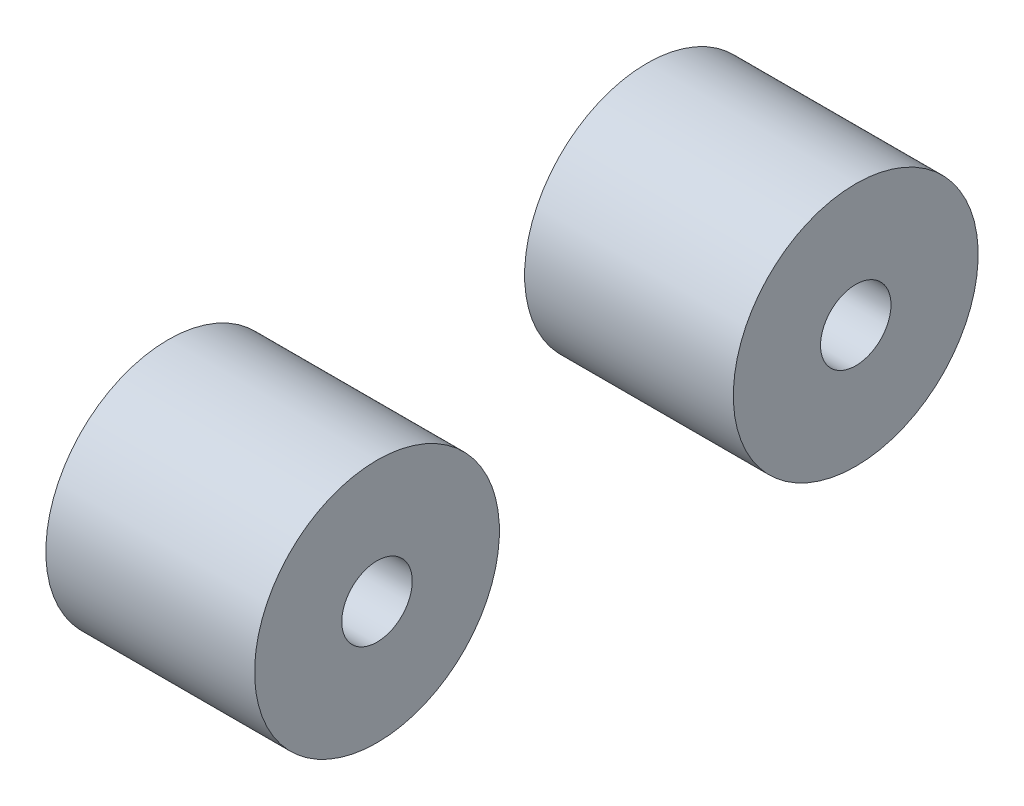
ISO-10303-21;
HEADER;
FILE_DESCRIPTION(('STEP AP214'),'2;1');
FILE_NAME('part.step','',(''),(''),'','','');
FILE_SCHEMA(('AUTOMOTIVE_DESIGN { 1 0 10303 214 1 1 1 1 }'));
ENDSEC;
DATA;
#1=APPLICATION_CONTEXT('core data for automotive mechanical design processes');
#2=APPLICATION_PROTOCOL_DEFINITION('international standard','automotive_design',2000,#1);
#3=PRODUCT_CONTEXT('',#1,'mechanical');
#4=PRODUCT('Part','Part','',(#3));
#5=PRODUCT_RELATED_PRODUCT_CATEGORY('part','',(#4));
#6=PRODUCT_DEFINITION_FORMATION('','',#4);
#7=PRODUCT_DEFINITION_CONTEXT('part definition',#1,'design');
#8=PRODUCT_DEFINITION('design','',#6,#7);
#9=PRODUCT_DEFINITION_SHAPE('','',#8);
#10=(LENGTH_UNIT() NAMED_UNIT(*) SI_UNIT(.MILLI.,.METRE.));
#11=(NAMED_UNIT(*) PLANE_ANGLE_UNIT() SI_UNIT($,.RADIAN.));
#12=(NAMED_UNIT(*) SI_UNIT($,.STERADIAN.) SOLID_ANGLE_UNIT());
#13=UNCERTAINTY_MEASURE_WITH_UNIT(LENGTH_MEASURE(1.E-05),#10,'distance_accuracy_value','');
#14=(GEOMETRIC_REPRESENTATION_CONTEXT(3) GLOBAL_UNCERTAINTY_ASSIGNED_CONTEXT((#13)) GLOBAL_UNIT_ASSIGNED_CONTEXT((#10,
#11,#12)) REPRESENTATION_CONTEXT('',''));
#15=CARTESIAN_POINT('',(0.,0.,0.));
#16=DIRECTION('',(0.,0.,1.));
#17=DIRECTION('',(1.,0.,0.));
#18=AXIS2_PLACEMENT_3D('',#15,#16,#17);
#19=CARTESIAN_POINT('',(8.255,0.,50.4527690620356));
#20=DIRECTION('',(1.,0.,0.));
#21=DIRECTION('',(0.,1.,0.));
#22=AXIS2_PLACEMENT_3D('',#19,#20,#21);
#23=PLANE('',#22);
#24=CARTESIAN_POINT('',(8.255,0.,50.4527690620356));
#25=DIRECTION('',(-1.,0.,0.));
#26=DIRECTION('',(0.,-1.,0.));
#27=AXIS2_PLACEMENT_3D('',#24,#25,#26);
#28=CIRCLE('',#27,3.71375);
#29=CARTESIAN_POINT('',(8.255,-3.71375,50.4527690620356));
#30=VERTEX_POINT('',#29);
#31=EDGE_CURVE('E59',#30,#30,#28,.T.);
#32=ORIENTED_EDGE('',*,*,#31,.F.);
#33=EDGE_LOOP('',(#32));
#34=FACE_BOUND('',#33,.T.);
#35=CARTESIAN_POINT('',(8.255,0.,50.4527690620356));
#36=DIRECTION('',(-1.,0.,0.));
#37=DIRECTION('',(0.,-1.,0.));
#38=AXIS2_PLACEMENT_3D('',#35,#36,#37);
#39=CIRCLE('',#38,12.9);
#40=CARTESIAN_POINT('',(8.255,-12.9,50.4527690620356));
#41=VERTEX_POINT('',#40);
#42=EDGE_CURVE('E11',#41,#41,#39,.T.);
#43=ORIENTED_EDGE('',*,*,#42,.T.);
#44=EDGE_LOOP('',(#43));
#45=FACE_BOUND('',#44,.T.);
#46=ADVANCED_FACE('F45',(#34,#45),#23,.F.);
#47=CARTESIAN_POINT('',(8.255,0.,50.4527690620356));
#48=DIRECTION('',(-1.,0.,0.));
#49=DIRECTION('',(0.,-1.,0.));
#50=AXIS2_PLACEMENT_3D('',#47,#48,#49);
#51=CYLINDRICAL_SURFACE('',#50,12.9);
#52=ORIENTED_EDGE('',*,*,#42,.F.);
#53=EDGE_LOOP('',(#52));
#54=FACE_BOUND('',#53,.T.);
#55=CARTESIAN_POINT('',(30.255,0.,50.4527690620356));
#56=DIRECTION('',(-1.,0.,0.));
#57=DIRECTION('',(0.,-1.,0.));
#58=AXIS2_PLACEMENT_3D('',#55,#56,#57);
#59=CIRCLE('',#58,12.9);
#60=CARTESIAN_POINT('',(30.255,-12.9,50.4527690620356));
#61=VERTEX_POINT('',#60);
#62=EDGE_CURVE('E51',#61,#61,#59,.T.);
#63=ORIENTED_EDGE('',*,*,#62,.T.);
#64=EDGE_LOOP('',(#63));
#65=FACE_BOUND('',#64,.T.);
#66=ADVANCED_FACE('F84',(#54,#65),#51,.T.);
#67=CARTESIAN_POINT('',(30.255,12.9,50.4527690620356));
#68=DIRECTION('',(-1.,0.,0.));
#69=DIRECTION('',(0.,-1.,0.));
#70=AXIS2_PLACEMENT_3D('',#67,#68,#69);
#71=PLANE('',#70);
#72=CARTESIAN_POINT('',(30.255,0.,50.4527690620356));
#73=DIRECTION('',(1.,0.,0.));
#74=DIRECTION('',(0.,0.,-1.));
#75=AXIS2_PLACEMENT_3D('',#72,#73,#74);
#76=CIRCLE('',#75,3.71375);
#77=CARTESIAN_POINT('',(30.255,0.,46.7390190620356));
#78=VERTEX_POINT('',#77);
#79=EDGE_CURVE('E65',#78,#78,#76,.T.);
#80=ORIENTED_EDGE('',*,*,#79,.F.);
#81=EDGE_LOOP('',(#80));
#82=FACE_BOUND('',#81,.T.);
#83=ORIENTED_EDGE('',*,*,#62,.F.);
#84=EDGE_LOOP('',(#83));
#85=FACE_BOUND('',#84,.T.);
#86=ADVANCED_FACE('F80',(#82,#85),#71,.F.);
#87=CARTESIAN_POINT('',(15.8275,0.,50.4527690620356));
#88=DIRECTION('',(-1.,0.,0.));
#89=DIRECTION('',(0.,-1.,0.));
#90=AXIS2_PLACEMENT_3D('',#87,#88,#89);
#91=CYLINDRICAL_SURFACE('',#90,3.71375);
#92=CARTESIAN_POINT('',(15.8275,0.,50.4527690620356));
#93=DIRECTION('',(-1.,0.,0.));
#94=DIRECTION('',(0.,-1.,0.));
#95=AXIS2_PLACEMENT_3D('',#92,#93,#94);
#96=CIRCLE('',#95,3.71375);
#97=CARTESIAN_POINT('',(15.8275,-3.71375,50.4527690620356));
#98=VERTEX_POINT('',#97);
#99=EDGE_CURVE('E55',#98,#98,#96,.T.);
#100=ORIENTED_EDGE('',*,*,#99,.F.);
#101=EDGE_LOOP('',(#100));
#102=FACE_BOUND('',#101,.T.);
#103=ORIENTED_EDGE('',*,*,#31,.T.);
#104=EDGE_LOOP('',(#103));
#105=FACE_BOUND('',#104,.T.);
#106=ADVANCED_FACE('F83',(#102,#105),#91,.F.);
#107=CARTESIAN_POINT('',(15.8275,0.,50.4527690620356));
#108=DIRECTION('',(-1.,0.,0.));
#109=DIRECTION('',(0.,-1.,0.));
#110=AXIS2_PLACEMENT_3D('',#107,#108,#109);
#111=PLANE('',#110);
#112=ORIENTED_EDGE('',*,*,#99,.T.);
#113=EDGE_LOOP('',(#112));
#114=FACE_BOUND('',#113,.T.);
#115=ADVANCED_FACE('F76',(#114),#111,.T.);
#116=CARTESIAN_POINT('',(23.1825,0.,50.4527690620356));
#117=DIRECTION('',(1.,0.,0.));
#118=DIRECTION('',(0.,0.,-1.));
#119=AXIS2_PLACEMENT_3D('',#116,#117,#118);
#120=CYLINDRICAL_SURFACE('',#119,3.71375);
#121=CARTESIAN_POINT('',(23.1825,0.,50.4527690620356));
#122=DIRECTION('',(1.,0.,0.));
#123=DIRECTION('',(0.,0.,-1.));
#124=AXIS2_PLACEMENT_3D('',#121,#122,#123);
#125=CIRCLE('',#124,3.71375);
#126=CARTESIAN_POINT('',(23.1825,0.,46.7390190620356));
#127=VERTEX_POINT('',#126);
#128=EDGE_CURVE('E63',#127,#127,#125,.T.);
#129=ORIENTED_EDGE('',*,*,#128,.F.);
#130=EDGE_LOOP('',(#129));
#131=FACE_BOUND('',#130,.T.);
#132=ORIENTED_EDGE('',*,*,#79,.T.);
#133=EDGE_LOOP('',(#132));
#134=FACE_BOUND('',#133,.T.);
#135=ADVANCED_FACE('F73',(#131,#134),#120,.F.);
#136=CARTESIAN_POINT('',(23.1825,0.,50.4527690620356));
#137=DIRECTION('',(1.,0.,0.));
#138=DIRECTION('',(0.,0.,-1.));
#139=AXIS2_PLACEMENT_3D('',#136,#137,#138);
#140=PLANE('',#139);
#141=ORIENTED_EDGE('',*,*,#128,.T.);
#142=EDGE_LOOP('',(#141));
#143=FACE_BOUND('',#142,.T.);
#144=ADVANCED_FACE('F71',(#143),#140,.T.);
#145=CLOSED_SHELL('',(#46,#66,#86,#106,#115,#135,#144));
#146=MANIFOLD_SOLID_BREP('B2_NOT_SHOWN',#145);
#147=CARTESIAN_POINT('',(8.255,0.,0.));
#148=DIRECTION('',(1.,0.,0.));
#149=DIRECTION('',(0.,1.,0.));
#150=AXIS2_PLACEMENT_3D('',#147,#148,#149);
#151=PLANE('',#150);
#152=CARTESIAN_POINT('',(8.255,0.,0.));
#153=DIRECTION('',(-1.,0.,0.));
#154=DIRECTION('',(0.,-1.,0.));
#155=AXIS2_PLACEMENT_3D('',#152,#153,#154);
#156=CIRCLE('',#155,3.71375);
#157=CARTESIAN_POINT('',(8.255,-3.71375,0.));
#158=VERTEX_POINT('',#157);
#159=EDGE_CURVE('E159',#158,#158,#156,.T.);
#160=ORIENTED_EDGE('',*,*,#159,.F.);
#161=EDGE_LOOP('',(#160));
#162=FACE_BOUND('',#161,.T.);
#163=CARTESIAN_POINT('',(8.255,0.,0.));
#164=DIRECTION('',(-1.,0.,0.));
#165=DIRECTION('',(0.,-1.,0.));
#166=AXIS2_PLACEMENT_3D('',#163,#164,#165);
#167=CIRCLE('',#166,12.9);
#168=CARTESIAN_POINT('',(8.255,-12.9,0.));
#169=VERTEX_POINT('',#168);
#170=EDGE_CURVE('E44',#169,#169,#167,.T.);
#171=ORIENTED_EDGE('',*,*,#170,.T.);
#172=EDGE_LOOP('',(#171));
#173=FACE_BOUND('',#172,.T.);
#174=ADVANCED_FACE('F145',(#162,#173),#151,.F.);
#175=CARTESIAN_POINT('',(8.255,0.,0.));
#176=DIRECTION('',(-1.,0.,0.));
#177=DIRECTION('',(0.,-1.,0.));
#178=AXIS2_PLACEMENT_3D('',#175,#176,#177);
#179=CYLINDRICAL_SURFACE('',#178,12.9);
#180=ORIENTED_EDGE('',*,*,#170,.F.);
#181=EDGE_LOOP('',(#180));
#182=FACE_BOUND('',#181,.T.);
#183=CARTESIAN_POINT('',(30.255,0.,0.));
#184=DIRECTION('',(-1.,0.,0.));
#185=DIRECTION('',(0.,-1.,0.));
#186=AXIS2_PLACEMENT_3D('',#183,#184,#185);
#187=CIRCLE('',#186,12.9);
#188=CARTESIAN_POINT('',(30.255,-12.9,0.));
#189=VERTEX_POINT('',#188);
#190=EDGE_CURVE('E151',#189,#189,#187,.T.);
#191=ORIENTED_EDGE('',*,*,#190,.T.);
#192=EDGE_LOOP('',(#191));
#193=FACE_BOUND('',#192,.T.);
#194=ADVANCED_FACE('F184',(#182,#193),#179,.T.);
#195=CARTESIAN_POINT('',(30.255,12.9,0.));
#196=DIRECTION('',(-1.,0.,0.));
#197=DIRECTION('',(0.,-1.,0.));
#198=AXIS2_PLACEMENT_3D('',#195,#196,#197);
#199=PLANE('',#198);
#200=CARTESIAN_POINT('',(30.255,0.,0.));
#201=DIRECTION('',(1.,0.,0.));
#202=DIRECTION('',(0.,0.,-1.));
#203=AXIS2_PLACEMENT_3D('',#200,#201,#202);
#204=CIRCLE('',#203,3.71375);
#205=CARTESIAN_POINT('',(30.255,0.,-3.71375));
#206=VERTEX_POINT('',#205);
#207=EDGE_CURVE('E165',#206,#206,#204,.T.);
#208=ORIENTED_EDGE('',*,*,#207,.F.);
#209=EDGE_LOOP('',(#208));
#210=FACE_BOUND('',#209,.T.);
#211=ORIENTED_EDGE('',*,*,#190,.F.);
#212=EDGE_LOOP('',(#211));
#213=FACE_BOUND('',#212,.T.);
#214=ADVANCED_FACE('F180',(#210,#213),#199,.F.);
#215=CARTESIAN_POINT('',(15.8275,0.,0.));
#216=DIRECTION('',(-1.,0.,0.));
#217=DIRECTION('',(0.,-1.,0.));
#218=AXIS2_PLACEMENT_3D('',#215,#216,#217);
#219=CYLINDRICAL_SURFACE('',#218,3.71375);
#220=CARTESIAN_POINT('',(15.8275,0.,0.));
#221=DIRECTION('',(-1.,0.,0.));
#222=DIRECTION('',(0.,-1.,0.));
#223=AXIS2_PLACEMENT_3D('',#220,#221,#222);
#224=CIRCLE('',#223,3.71375);
#225=CARTESIAN_POINT('',(15.8275,-3.71375,0.));
#226=VERTEX_POINT('',#225);
#227=EDGE_CURVE('E155',#226,#226,#224,.T.);
#228=ORIENTED_EDGE('',*,*,#227,.F.);
#229=EDGE_LOOP('',(#228));
#230=FACE_BOUND('',#229,.T.);
#231=ORIENTED_EDGE('',*,*,#159,.T.);
#232=EDGE_LOOP('',(#231));
#233=FACE_BOUND('',#232,.T.);
#234=ADVANCED_FACE('F183',(#230,#233),#219,.F.);
#235=CARTESIAN_POINT('',(15.8275,0.,0.));
#236=DIRECTION('',(-1.,0.,0.));
#237=DIRECTION('',(0.,-1.,0.));
#238=AXIS2_PLACEMENT_3D('',#235,#236,#237);
#239=PLANE('',#238);
#240=ORIENTED_EDGE('',*,*,#227,.T.);
#241=EDGE_LOOP('',(#240));
#242=FACE_BOUND('',#241,.T.);
#243=ADVANCED_FACE('F176',(#242),#239,.T.);
#244=CARTESIAN_POINT('',(23.1825,0.,0.));
#245=DIRECTION('',(1.,0.,0.));
#246=DIRECTION('',(0.,0.,-1.));
#247=AXIS2_PLACEMENT_3D('',#244,#245,#246);
#248=CYLINDRICAL_SURFACE('',#247,3.71375);
#249=CARTESIAN_POINT('',(23.1825,0.,0.));
#250=DIRECTION('',(1.,0.,0.));
#251=DIRECTION('',(0.,0.,-1.));
#252=AXIS2_PLACEMENT_3D('',#249,#250,#251);
#253=CIRCLE('',#252,3.71375);
#254=CARTESIAN_POINT('',(23.1825,0.,-3.71375));
#255=VERTEX_POINT('',#254);
#256=EDGE_CURVE('E163',#255,#255,#253,.T.);
#257=ORIENTED_EDGE('',*,*,#256,.F.);
#258=EDGE_LOOP('',(#257));
#259=FACE_BOUND('',#258,.T.);
#260=ORIENTED_EDGE('',*,*,#207,.T.);
#261=EDGE_LOOP('',(#260));
#262=FACE_BOUND('',#261,.T.);
#263=ADVANCED_FACE('F173',(#259,#262),#248,.F.);
#264=CARTESIAN_POINT('',(23.1825,0.,0.));
#265=DIRECTION('',(1.,0.,0.));
#266=DIRECTION('',(0.,0.,-1.));
#267=AXIS2_PLACEMENT_3D('',#264,#265,#266);
#268=PLANE('',#267);
#269=ORIENTED_EDGE('',*,*,#256,.T.);
#270=EDGE_LOOP('',(#269));
#271=FACE_BOUND('',#270,.T.);
#272=ADVANCED_FACE('F171',(#271),#268,.T.);
#273=CLOSED_SHELL('',(#174,#194,#214,#234,#243,#263,#272));
#274=MANIFOLD_SOLID_BREP('B6',#273);
#275=ADVANCED_BREP_SHAPE_REPRESENTATION('',(#18,#146,#274),#14);
#276=SHAPE_DEFINITION_REPRESENTATION(#9,#275);
ENDSEC;
END-ISO-10303-21;
